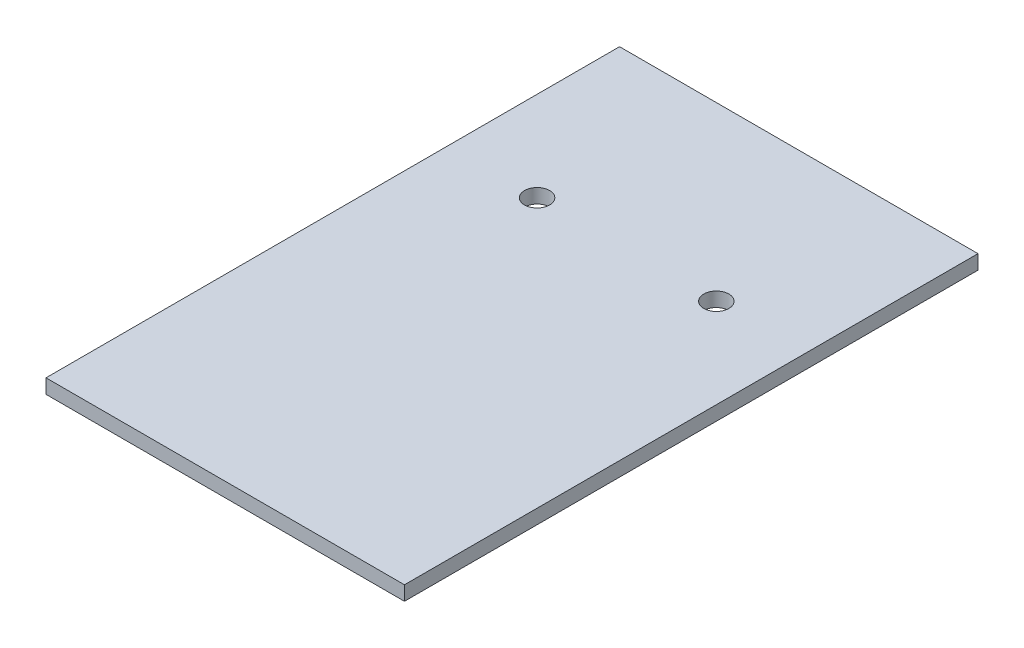
ISO-10303-21;
HEADER;
FILE_DESCRIPTION(('STEP AP214'),'2;1');
FILE_NAME('part.step','',(''),(''),'','','');
FILE_SCHEMA(('AUTOMOTIVE_DESIGN { 1 0 10303 214 1 1 1 1 }'));
ENDSEC;
DATA;
#1=APPLICATION_CONTEXT('core data for automotive mechanical design processes');
#2=APPLICATION_PROTOCOL_DEFINITION('international standard','automotive_design',2000,#1);
#3=PRODUCT_CONTEXT('',#1,'mechanical');
#4=PRODUCT('Part','Part','',(#3));
#5=PRODUCT_RELATED_PRODUCT_CATEGORY('part','',(#4));
#6=PRODUCT_DEFINITION_FORMATION('','',#4);
#7=PRODUCT_DEFINITION_CONTEXT('part definition',#1,'design');
#8=PRODUCT_DEFINITION('design','',#6,#7);
#9=PRODUCT_DEFINITION_SHAPE('','',#8);
#10=(LENGTH_UNIT() NAMED_UNIT(*) SI_UNIT(.MILLI.,.METRE.));
#11=(NAMED_UNIT(*) PLANE_ANGLE_UNIT() SI_UNIT($,.RADIAN.));
#12=(NAMED_UNIT(*) SI_UNIT($,.STERADIAN.) SOLID_ANGLE_UNIT());
#13=UNCERTAINTY_MEASURE_WITH_UNIT(LENGTH_MEASURE(1.E-05),#10,'distance_accuracy_value','');
#14=(GEOMETRIC_REPRESENTATION_CONTEXT(3) GLOBAL_UNCERTAINTY_ASSIGNED_CONTEXT((#13)) GLOBAL_UNIT_ASSIGNED_CONTEXT((#10,
#11,#12)) REPRESENTATION_CONTEXT('',''));
#15=CARTESIAN_POINT('',(0.,0.,0.));
#16=DIRECTION('',(0.,0.,1.));
#17=DIRECTION('',(1.,0.,0.));
#18=AXIS2_PLACEMENT_3D('',#15,#16,#17);
#19=CARTESIAN_POINT('',(0.,2.,0.));
#20=DIRECTION('',(1.,0.,0.));
#21=DIRECTION('',(0.,0.,-1.));
#22=AXIS2_PLACEMENT_3D('',#19,#20,#21);
#23=PLANE('',#22);
#24=DIRECTION('',(0.,0.,1.));
#25=VECTOR('',#24,1.);
#26=CARTESIAN_POINT('',(0.,0.,0.));
#27=LINE('',#26,#25);
#28=CARTESIAN_POINT('',(0.,0.,-80.));
#29=VERTEX_POINT('',#28);
#30=CARTESIAN_POINT('',(0.,0.,0.));
#31=VERTEX_POINT('',#30);
#32=EDGE_CURVE('E98',#29,#31,#27,.T.);
#33=ORIENTED_EDGE('',*,*,#32,.T.);
#34=DIRECTION('',(0.,-1.,0.));
#35=VECTOR('',#34,1.);
#36=CARTESIAN_POINT('',(0.,2.,0.));
#37=LINE('',#36,#35);
#38=CARTESIAN_POINT('',(0.,2.,0.));
#39=VERTEX_POINT('',#38);
#40=EDGE_CURVE('E11',#39,#31,#37,.T.);
#41=ORIENTED_EDGE('',*,*,#40,.F.);
#42=DIRECTION('',(0.,0.,1.));
#43=VECTOR('',#42,1.);
#44=CARTESIAN_POINT('',(0.,2.,0.));
#45=LINE('',#44,#43);
#46=CARTESIAN_POINT('',(0.,2.,-80.));
#47=VERTEX_POINT('',#46);
#48=EDGE_CURVE('E86',#47,#39,#45,.T.);
#49=ORIENTED_EDGE('',*,*,#48,.F.);
#50=DIRECTION('',(0.,-1.,0.));
#51=VECTOR('',#50,1.);
#52=CARTESIAN_POINT('',(0.,2.,-80.));
#53=LINE('',#52,#51);
#54=EDGE_CURVE('E94',#47,#29,#53,.T.);
#55=ORIENTED_EDGE('',*,*,#54,.T.);
#56=EDGE_LOOP('',(#33,#41,#49,#55));
#57=FACE_BOUND('',#56,.T.);
#58=ADVANCED_FACE('F35',(#57),#23,.F.);
#59=CARTESIAN_POINT('',(0.,2.,0.));
#60=DIRECTION('',(0.,0.,-1.));
#61=DIRECTION('',(-1.,0.,0.));
#62=AXIS2_PLACEMENT_3D('',#59,#60,#61);
#63=PLANE('',#62);
#64=DIRECTION('',(1.,0.,0.));
#65=VECTOR('',#64,1.);
#66=CARTESIAN_POINT('',(0.,0.,0.));
#67=LINE('',#66,#65);
#68=CARTESIAN_POINT('',(50.,0.,0.));
#69=VERTEX_POINT('',#68);
#70=EDGE_CURVE('E90',#31,#69,#67,.T.);
#71=ORIENTED_EDGE('',*,*,#70,.T.);
#72=DIRECTION('',(0.,-1.,0.));
#73=VECTOR('',#72,1.);
#74=CARTESIAN_POINT('',(50.,2.,0.));
#75=LINE('',#74,#73);
#76=CARTESIAN_POINT('',(50.,2.,0.));
#77=VERTEX_POINT('',#76);
#78=EDGE_CURVE('E43',#77,#69,#75,.T.);
#79=ORIENTED_EDGE('',*,*,#78,.F.);
#80=DIRECTION('',(1.,0.,0.));
#81=VECTOR('',#80,1.);
#82=CARTESIAN_POINT('',(0.,2.,0.));
#83=LINE('',#82,#81);
#84=EDGE_CURVE('E81',#39,#77,#83,.T.);
#85=ORIENTED_EDGE('',*,*,#84,.F.);
#86=ORIENTED_EDGE('',*,*,#40,.T.);
#87=EDGE_LOOP('',(#71,#79,#85,#86));
#88=FACE_BOUND('',#87,.T.);
#89=ADVANCED_FACE('F89',(#88),#63,.F.);
#90=CARTESIAN_POINT('',(50.,2.,0.));
#91=DIRECTION('',(-1.,0.,0.));
#92=DIRECTION('',(0.,0.,1.));
#93=AXIS2_PLACEMENT_3D('',#90,#91,#92);
#94=PLANE('',#93);
#95=DIRECTION('',(0.,0.,-1.));
#96=VECTOR('',#95,1.);
#97=CARTESIAN_POINT('',(50.,0.,0.));
#98=LINE('',#97,#96);
#99=CARTESIAN_POINT('',(50.,0.,-80.));
#100=VERTEX_POINT('',#99);
#101=EDGE_CURVE('E68',#69,#100,#98,.T.);
#102=ORIENTED_EDGE('',*,*,#101,.T.);
#103=DIRECTION('',(0.,-1.,0.));
#104=VECTOR('',#103,1.);
#105=CARTESIAN_POINT('',(50.,2.,-80.));
#106=LINE('',#105,#104);
#107=CARTESIAN_POINT('',(50.,2.,-80.));
#108=VERTEX_POINT('',#107);
#109=EDGE_CURVE('E91',#108,#100,#106,.T.);
#110=ORIENTED_EDGE('',*,*,#109,.F.);
#111=DIRECTION('',(0.,0.,-1.));
#112=VECTOR('',#111,1.);
#113=CARTESIAN_POINT('',(50.,2.,0.));
#114=LINE('',#113,#112);
#115=EDGE_CURVE('E84',#77,#108,#114,.T.);
#116=ORIENTED_EDGE('',*,*,#115,.F.);
#117=ORIENTED_EDGE('',*,*,#78,.T.);
#118=EDGE_LOOP('',(#102,#110,#116,#117));
#119=FACE_BOUND('',#118,.T.);
#120=ADVANCED_FACE('F92',(#119),#94,.F.);
#121=CARTESIAN_POINT('',(0.,2.,-80.));
#122=DIRECTION('',(0.,0.,1.));
#123=DIRECTION('',(1.,0.,0.));
#124=AXIS2_PLACEMENT_3D('',#121,#122,#123);
#125=PLANE('',#124);
#126=DIRECTION('',(-1.,0.,0.));
#127=VECTOR('',#126,1.);
#128=CARTESIAN_POINT('',(0.,0.,-80.));
#129=LINE('',#128,#127);
#130=EDGE_CURVE('E74',#100,#29,#129,.T.);
#131=ORIENTED_EDGE('',*,*,#130,.T.);
#132=ORIENTED_EDGE('',*,*,#54,.F.);
#133=DIRECTION('',(-1.,0.,0.));
#134=VECTOR('',#133,1.);
#135=CARTESIAN_POINT('',(0.,2.,-80.));
#136=LINE('',#135,#134);
#137=EDGE_CURVE('E51',#108,#47,#136,.T.);
#138=ORIENTED_EDGE('',*,*,#137,.F.);
#139=ORIENTED_EDGE('',*,*,#109,.T.);
#140=EDGE_LOOP('',(#131,#132,#138,#139));
#141=FACE_BOUND('',#140,.T.);
#142=ADVANCED_FACE('F106',(#141),#125,.F.);
#143=CARTESIAN_POINT('',(0.,2.,0.));
#144=DIRECTION('',(0.,-1.,0.));
#145=DIRECTION('',(0.,0.,-1.));
#146=AXIS2_PLACEMENT_3D('',#143,#144,#145);
#147=PLANE('',#146);
#148=CARTESIAN_POINT('',(37.5,2.,-56.));
#149=DIRECTION('',(0.,1.,0.));
#150=DIRECTION('',(0.,0.,-1.));
#151=AXIS2_PLACEMENT_3D('',#148,#149,#150);
#152=CIRCLE('',#151,1.75);
#153=CARTESIAN_POINT('',(37.5,2.,-57.75));
#154=VERTEX_POINT('',#153);
#155=EDGE_CURVE('E115',#154,#154,#152,.T.);
#156=ORIENTED_EDGE('',*,*,#155,.F.);
#157=EDGE_LOOP('',(#156));
#158=FACE_BOUND('',#157,.T.);
#159=CARTESIAN_POINT('',(12.5,2.,-56.));
#160=DIRECTION('',(0.,1.,0.));
#161=DIRECTION('',(0.,0.,1.));
#162=AXIS2_PLACEMENT_3D('',#159,#160,#161);
#163=CIRCLE('',#162,1.75);
#164=CARTESIAN_POINT('',(12.5,2.,-54.25));
#165=VERTEX_POINT('',#164);
#166=EDGE_CURVE('E101',#165,#165,#163,.T.);
#167=ORIENTED_EDGE('',*,*,#166,.F.);
#168=EDGE_LOOP('',(#167));
#169=FACE_BOUND('',#168,.T.);
#170=ORIENTED_EDGE('',*,*,#48,.T.);
#171=ORIENTED_EDGE('',*,*,#84,.T.);
#172=ORIENTED_EDGE('',*,*,#115,.T.);
#173=ORIENTED_EDGE('',*,*,#137,.T.);
#174=EDGE_LOOP('',(#170,#171,#172,#173));
#175=FACE_BOUND('',#174,.T.);
#176=ADVANCED_FACE('F82',(#158,#169,#175),#147,.F.);
#177=CARTESIAN_POINT('',(0.,0.,0.));
#178=DIRECTION('',(0.,-1.,0.));
#179=DIRECTION('',(0.,0.,-1.));
#180=AXIS2_PLACEMENT_3D('',#177,#178,#179);
#181=PLANE('',#180);
#182=CARTESIAN_POINT('',(37.5,0.,-56.));
#183=DIRECTION('',(0.,-1.,0.));
#184=DIRECTION('',(0.,0.,-1.));
#185=AXIS2_PLACEMENT_3D('',#182,#183,#184);
#186=CIRCLE('',#185,1.75);
#187=CARTESIAN_POINT('',(37.5,0.,-57.75));
#188=VERTEX_POINT('',#187);
#189=EDGE_CURVE('E118',#188,#188,#186,.F.);
#190=ORIENTED_EDGE('',*,*,#189,.T.);
#191=EDGE_LOOP('',(#190));
#192=FACE_BOUND('',#191,.T.);
#193=CARTESIAN_POINT('',(12.5,0.,-56.));
#194=DIRECTION('',(0.,-1.,0.));
#195=DIRECTION('',(0.,0.,-1.));
#196=AXIS2_PLACEMENT_3D('',#193,#194,#195);
#197=CIRCLE('',#196,1.75);
#198=CARTESIAN_POINT('',(12.5,0.,-57.75));
#199=VERTEX_POINT('',#198);
#200=EDGE_CURVE('E112',#199,#199,#197,.F.);
#201=ORIENTED_EDGE('',*,*,#200,.T.);
#202=EDGE_LOOP('',(#201));
#203=FACE_BOUND('',#202,.T.);
#204=ORIENTED_EDGE('',*,*,#32,.F.);
#205=ORIENTED_EDGE('',*,*,#130,.F.);
#206=ORIENTED_EDGE('',*,*,#101,.F.);
#207=ORIENTED_EDGE('',*,*,#70,.F.);
#208=EDGE_LOOP('',(#204,#205,#206,#207));
#209=FACE_BOUND('',#208,.T.);
#210=ADVANCED_FACE('F109',(#192,#203,#209),#181,.T.);
#211=CARTESIAN_POINT('',(12.5,-0.00100000000000013,-56.));
#212=DIRECTION('',(0.,1.,0.));
#213=DIRECTION('',(0.,0.,1.));
#214=AXIS2_PLACEMENT_3D('',#211,#212,#213);
#215=CYLINDRICAL_SURFACE('',#214,1.75);
#216=ORIENTED_EDGE('',*,*,#200,.F.);
#217=EDGE_LOOP('',(#216));
#218=FACE_BOUND('',#217,.T.);
#219=ORIENTED_EDGE('',*,*,#166,.T.);
#220=EDGE_LOOP('',(#219));
#221=FACE_BOUND('',#220,.T.);
#222=ADVANCED_FACE('F131',(#218,#221),#215,.F.);
#223=CARTESIAN_POINT('',(37.5,-0.00100000000000013,-56.));
#224=DIRECTION('',(0.,1.,0.));
#225=DIRECTION('',(0.,0.,1.));
#226=AXIS2_PLACEMENT_3D('',#223,#224,#225);
#227=CYLINDRICAL_SURFACE('',#226,1.75);
#228=ORIENTED_EDGE('',*,*,#189,.F.);
#229=EDGE_LOOP('',(#228));
#230=FACE_BOUND('',#229,.T.);
#231=ORIENTED_EDGE('',*,*,#155,.T.);
#232=EDGE_LOOP('',(#231));
#233=FACE_BOUND('',#232,.T.);
#234=ADVANCED_FACE('F124',(#230,#233),#227,.F.);
#235=CLOSED_SHELL('',(#58,#89,#120,#142,#176,#210,#222,#234));
#236=MANIFOLD_SOLID_BREP('B2',#235);
#237=ADVANCED_BREP_SHAPE_REPRESENTATION('',(#18,#236),#14);
#238=SHAPE_DEFINITION_REPRESENTATION(#9,#237);
ENDSEC;
END-ISO-10303-21;
